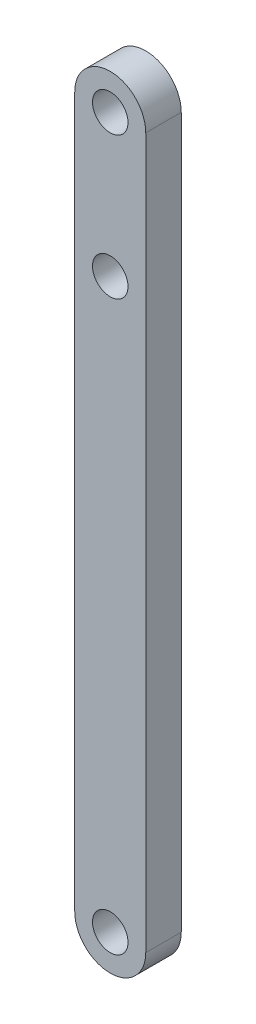
ISO-10303-21;
HEADER;
FILE_DESCRIPTION(('STEP AP214'),'2;1');
FILE_NAME('part.step','',(''),(''),'','','');
FILE_SCHEMA(('AUTOMOTIVE_DESIGN { 1 0 10303 214 1 1 1 1 }'));
ENDSEC;
DATA;
#1=APPLICATION_CONTEXT('core data for automotive mechanical design processes');
#2=APPLICATION_PROTOCOL_DEFINITION('international standard','automotive_design',2000,#1);
#3=PRODUCT_CONTEXT('',#1,'mechanical');
#4=PRODUCT('Part','Part','',(#3));
#5=PRODUCT_RELATED_PRODUCT_CATEGORY('part','',(#4));
#6=PRODUCT_DEFINITION_FORMATION('','',#4);
#7=PRODUCT_DEFINITION_CONTEXT('part definition',#1,'design');
#8=PRODUCT_DEFINITION('design','',#6,#7);
#9=PRODUCT_DEFINITION_SHAPE('','',#8);
#10=(LENGTH_UNIT() NAMED_UNIT(*) SI_UNIT(.MILLI.,.METRE.));
#11=(NAMED_UNIT(*) PLANE_ANGLE_UNIT() SI_UNIT($,.RADIAN.));
#12=(NAMED_UNIT(*) SI_UNIT($,.STERADIAN.) SOLID_ANGLE_UNIT());
#13=UNCERTAINTY_MEASURE_WITH_UNIT(LENGTH_MEASURE(1.E-05),#10,'distance_accuracy_value','');
#14=(GEOMETRIC_REPRESENTATION_CONTEXT(3) GLOBAL_UNCERTAINTY_ASSIGNED_CONTEXT((#13)) GLOBAL_UNIT_ASSIGNED_CONTEXT((#10,
#11,#12)) REPRESENTATION_CONTEXT('',''));
#15=CARTESIAN_POINT('',(0.,0.,0.));
#16=DIRECTION('',(0.,0.,1.));
#17=DIRECTION('',(1.,0.,0.));
#18=AXIS2_PLACEMENT_3D('',#15,#16,#17);
#19=CARTESIAN_POINT('',(3.,0.,3.));
#20=DIRECTION('',(0.,0.,-1.));
#21=DIRECTION('',(-1.,0.,0.));
#22=AXIS2_PLACEMENT_3D('',#19,#20,#21);
#23=CYLINDRICAL_SURFACE('',#22,3.);
#24=CARTESIAN_POINT('',(3.,0.,0.));
#25=DIRECTION('',(0.,0.,1.));
#26=DIRECTION('',(1.,0.,0.));
#27=AXIS2_PLACEMENT_3D('',#24,#25,#26);
#28=CIRCLE('',#27,3.);
#29=CARTESIAN_POINT('',(0.,0.,0.));
#30=VERTEX_POINT('',#29);
#31=CARTESIAN_POINT('',(6.,0.,0.));
#32=VERTEX_POINT('',#31);
#33=EDGE_CURVE('E99',#30,#32,#28,.T.);
#34=ORIENTED_EDGE('',*,*,#33,.T.);
#35=DIRECTION('',(0.,0.,-1.));
#36=VECTOR('',#35,1.);
#37=CARTESIAN_POINT('',(6.,0.,3.));
#38=LINE('',#37,#36);
#39=CARTESIAN_POINT('',(6.,0.,3.));
#40=VERTEX_POINT('',#39);
#41=EDGE_CURVE('E11',#40,#32,#38,.T.);
#42=ORIENTED_EDGE('',*,*,#41,.F.);
#43=CARTESIAN_POINT('',(3.,0.,3.));
#44=DIRECTION('',(0.,0.,1.));
#45=DIRECTION('',(1.,0.,0.));
#46=AXIS2_PLACEMENT_3D('',#43,#44,#45);
#47=CIRCLE('',#46,3.);
#48=CARTESIAN_POINT('',(0.,0.,3.));
#49=VERTEX_POINT('',#48);
#50=EDGE_CURVE('E87',#49,#40,#47,.T.);
#51=ORIENTED_EDGE('',*,*,#50,.F.);
#52=DIRECTION('',(0.,0.,-1.));
#53=VECTOR('',#52,1.);
#54=CARTESIAN_POINT('',(0.,0.,3.));
#55=LINE('',#54,#53);
#56=EDGE_CURVE('E95',#49,#30,#55,.T.);
#57=ORIENTED_EDGE('',*,*,#56,.T.);
#58=EDGE_LOOP('',(#34,#42,#51,#57));
#59=FACE_BOUND('',#58,.T.);
#60=ADVANCED_FACE('F36',(#59),#23,.T.);
#61=CARTESIAN_POINT('',(6.,60.,3.));
#62=DIRECTION('',(-1.,0.,0.));
#63=DIRECTION('',(0.,0.,1.));
#64=AXIS2_PLACEMENT_3D('',#61,#62,#63);
#65=PLANE('',#64);
#66=DIRECTION('',(0.,1.,0.));
#67=VECTOR('',#66,1.);
#68=CARTESIAN_POINT('',(6.,60.,0.));
#69=LINE('',#68,#67);
#70=CARTESIAN_POINT('',(6.,60.,0.));
#71=VERTEX_POINT('',#70);
#72=EDGE_CURVE('E91',#32,#71,#69,.T.);
#73=ORIENTED_EDGE('',*,*,#72,.T.);
#74=DIRECTION('',(0.,0.,-1.));
#75=VECTOR('',#74,1.);
#76=CARTESIAN_POINT('',(6.,60.,3.));
#77=LINE('',#76,#75);
#78=CARTESIAN_POINT('',(6.,60.,3.));
#79=VERTEX_POINT('',#78);
#80=EDGE_CURVE('E44',#79,#71,#77,.T.);
#81=ORIENTED_EDGE('',*,*,#80,.F.);
#82=DIRECTION('',(0.,1.,0.));
#83=VECTOR('',#82,1.);
#84=CARTESIAN_POINT('',(6.,60.,3.));
#85=LINE('',#84,#83);
#86=EDGE_CURVE('E82',#40,#79,#85,.T.);
#87=ORIENTED_EDGE('',*,*,#86,.F.);
#88=ORIENTED_EDGE('',*,*,#41,.T.);
#89=EDGE_LOOP('',(#73,#81,#87,#88));
#90=FACE_BOUND('',#89,.T.);
#91=ADVANCED_FACE('F90',(#90),#65,.F.);
#92=CARTESIAN_POINT('',(3.,60.,3.));
#93=DIRECTION('',(0.,0.,-1.));
#94=DIRECTION('',(-1.,0.,0.));
#95=AXIS2_PLACEMENT_3D('',#92,#93,#94);
#96=CYLINDRICAL_SURFACE('',#95,3.);
#97=CARTESIAN_POINT('',(3.,60.,0.));
#98=DIRECTION('',(0.,0.,1.));
#99=DIRECTION('',(1.,0.,0.));
#100=AXIS2_PLACEMENT_3D('',#97,#98,#99);
#101=CIRCLE('',#100,3.);
#102=CARTESIAN_POINT('',(0.,60.,0.));
#103=VERTEX_POINT('',#102);
#104=EDGE_CURVE('E69',#71,#103,#101,.T.);
#105=ORIENTED_EDGE('',*,*,#104,.T.);
#106=DIRECTION('',(0.,0.,-1.));
#107=VECTOR('',#106,1.);
#108=CARTESIAN_POINT('',(0.,60.,3.));
#109=LINE('',#108,#107);
#110=CARTESIAN_POINT('',(0.,60.,3.));
#111=VERTEX_POINT('',#110);
#112=EDGE_CURVE('E92',#111,#103,#109,.T.);
#113=ORIENTED_EDGE('',*,*,#112,.F.);
#114=CARTESIAN_POINT('',(3.,60.,3.));
#115=DIRECTION('',(0.,0.,1.));
#116=DIRECTION('',(1.,0.,0.));
#117=AXIS2_PLACEMENT_3D('',#114,#115,#116);
#118=CIRCLE('',#117,3.);
#119=EDGE_CURVE('E85',#79,#111,#118,.T.);
#120=ORIENTED_EDGE('',*,*,#119,.F.);
#121=ORIENTED_EDGE('',*,*,#80,.T.);
#122=EDGE_LOOP('',(#105,#113,#120,#121));
#123=FACE_BOUND('',#122,.T.);
#124=ADVANCED_FACE('F93',(#123),#96,.T.);
#125=CARTESIAN_POINT('',(0.,0.,3.));
#126=DIRECTION('',(1.,0.,0.));
#127=DIRECTION('',(0.,0.,-1.));
#128=AXIS2_PLACEMENT_3D('',#125,#126,#127);
#129=PLANE('',#128);
#130=DIRECTION('',(0.,-1.,0.));
#131=VECTOR('',#130,1.);
#132=CARTESIAN_POINT('',(0.,0.,0.));
#133=LINE('',#132,#131);
#134=EDGE_CURVE('E75',#103,#30,#133,.T.);
#135=ORIENTED_EDGE('',*,*,#134,.T.);
#136=ORIENTED_EDGE('',*,*,#56,.F.);
#137=DIRECTION('',(0.,-1.,0.));
#138=VECTOR('',#137,1.);
#139=CARTESIAN_POINT('',(0.,0.,3.));
#140=LINE('',#139,#138);
#141=EDGE_CURVE('E52',#111,#49,#140,.T.);
#142=ORIENTED_EDGE('',*,*,#141,.F.);
#143=ORIENTED_EDGE('',*,*,#112,.T.);
#144=EDGE_LOOP('',(#135,#136,#142,#143));
#145=FACE_BOUND('',#144,.T.);
#146=ADVANCED_FACE('F107',(#145),#129,.F.);
#147=CARTESIAN_POINT('',(3.,0.,3.));
#148=DIRECTION('',(0.,0.,1.));
#149=DIRECTION('',(1.,0.,0.));
#150=AXIS2_PLACEMENT_3D('',#147,#148,#149);
#151=PLANE('',#150);
#152=CARTESIAN_POINT('',(3.,0.,3.));
#153=DIRECTION('',(0.,0.,1.));
#154=DIRECTION('',(1.,0.,0.));
#155=AXIS2_PLACEMENT_3D('',#152,#153,#154);
#156=CIRCLE('',#155,1.5);
#157=CARTESIAN_POINT('',(4.5,0.,3.));
#158=VERTEX_POINT('',#157);
#159=EDGE_CURVE('E102',#158,#158,#156,.F.);
#160=ORIENTED_EDGE('',*,*,#159,.T.);
#161=EDGE_LOOP('',(#160));
#162=FACE_BOUND('',#161,.T.);
#163=CARTESIAN_POINT('',(3.,60.,3.));
#164=DIRECTION('',(0.,0.,1.));
#165=DIRECTION('',(1.,0.,0.));
#166=AXIS2_PLACEMENT_3D('',#163,#164,#165);
#167=CIRCLE('',#166,1.5);
#168=CARTESIAN_POINT('',(4.5,60.,3.));
#169=VERTEX_POINT('',#168);
#170=EDGE_CURVE('E115',#169,#169,#167,.F.);
#171=ORIENTED_EDGE('',*,*,#170,.T.);
#172=EDGE_LOOP('',(#171));
#173=FACE_BOUND('',#172,.T.);
#174=CARTESIAN_POINT('',(3.,48.,3.));
#175=DIRECTION('',(0.,0.,1.));
#176=DIRECTION('',(1.,0.,0.));
#177=AXIS2_PLACEMENT_3D('',#174,#175,#176);
#178=CIRCLE('',#177,1.5);
#179=CARTESIAN_POINT('',(4.5,48.,3.));
#180=VERTEX_POINT('',#179);
#181=EDGE_CURVE('E118',#180,#180,#178,.F.);
#182=ORIENTED_EDGE('',*,*,#181,.T.);
#183=EDGE_LOOP('',(#182));
#184=FACE_BOUND('',#183,.T.);
#185=ORIENTED_EDGE('',*,*,#50,.T.);
#186=ORIENTED_EDGE('',*,*,#86,.T.);
#187=ORIENTED_EDGE('',*,*,#119,.T.);
#188=ORIENTED_EDGE('',*,*,#141,.T.);
#189=EDGE_LOOP('',(#185,#186,#187,#188));
#190=FACE_BOUND('',#189,.T.);
#191=ADVANCED_FACE('F83',(#162,#173,#184,#190),#151,.T.);
#192=CARTESIAN_POINT('',(3.,0.,0.));
#193=DIRECTION('',(0.,0.,1.));
#194=DIRECTION('',(1.,0.,0.));
#195=AXIS2_PLACEMENT_3D('',#192,#193,#194);
#196=PLANE('',#195);
#197=CARTESIAN_POINT('',(3.,0.,0.));
#198=DIRECTION('',(0.,0.,1.));
#199=DIRECTION('',(1.,0.,0.));
#200=AXIS2_PLACEMENT_3D('',#197,#198,#199);
#201=CIRCLE('',#200,1.5);
#202=CARTESIAN_POINT('',(4.5,0.,0.));
#203=VERTEX_POINT('',#202);
#204=EDGE_CURVE('E121',#203,#203,#201,.T.);
#205=ORIENTED_EDGE('',*,*,#204,.T.);
#206=EDGE_LOOP('',(#205));
#207=FACE_BOUND('',#206,.T.);
#208=CARTESIAN_POINT('',(3.,60.,0.));
#209=DIRECTION('',(0.,0.,1.));
#210=DIRECTION('',(1.,0.,0.));
#211=AXIS2_PLACEMENT_3D('',#208,#209,#210);
#212=CIRCLE('',#211,1.5);
#213=CARTESIAN_POINT('',(4.5,60.,0.));
#214=VERTEX_POINT('',#213);
#215=EDGE_CURVE('E125',#214,#214,#212,.T.);
#216=ORIENTED_EDGE('',*,*,#215,.T.);
#217=EDGE_LOOP('',(#216));
#218=FACE_BOUND('',#217,.T.);
#219=CARTESIAN_POINT('',(3.,48.,0.));
#220=DIRECTION('',(0.,0.,1.));
#221=DIRECTION('',(1.,0.,0.));
#222=AXIS2_PLACEMENT_3D('',#219,#220,#221);
#223=CIRCLE('',#222,1.5);
#224=CARTESIAN_POINT('',(4.5,48.,0.));
#225=VERTEX_POINT('',#224);
#226=EDGE_CURVE('E122',#225,#225,#223,.T.);
#227=ORIENTED_EDGE('',*,*,#226,.T.);
#228=EDGE_LOOP('',(#227));
#229=FACE_BOUND('',#228,.T.);
#230=ORIENTED_EDGE('',*,*,#33,.F.);
#231=ORIENTED_EDGE('',*,*,#134,.F.);
#232=ORIENTED_EDGE('',*,*,#104,.F.);
#233=ORIENTED_EDGE('',*,*,#72,.F.);
#234=EDGE_LOOP('',(#230,#231,#232,#233));
#235=FACE_BOUND('',#234,.T.);
#236=ADVANCED_FACE('F110',(#207,#218,#229,#235),#196,.F.);
#237=CARTESIAN_POINT('',(3.,48.,5.));
#238=DIRECTION('',(0.,0.,-1.));
#239=DIRECTION('',(-1.,0.,0.));
#240=AXIS2_PLACEMENT_3D('',#237,#238,#239);
#241=CYLINDRICAL_SURFACE('',#240,1.5);
#242=ORIENTED_EDGE('',*,*,#181,.F.);
#243=EDGE_LOOP('',(#242));
#244=FACE_BOUND('',#243,.T.);
#245=ORIENTED_EDGE('',*,*,#226,.F.);
#246=EDGE_LOOP('',(#245));
#247=FACE_BOUND('',#246,.T.);
#248=ADVANCED_FACE('F141',(#244,#247),#241,.F.);
#249=CARTESIAN_POINT('',(3.,60.,5.));
#250=DIRECTION('',(0.,0.,-1.));
#251=DIRECTION('',(-1.,0.,0.));
#252=AXIS2_PLACEMENT_3D('',#249,#250,#251);
#253=CYLINDRICAL_SURFACE('',#252,1.5);
#254=ORIENTED_EDGE('',*,*,#170,.F.);
#255=EDGE_LOOP('',(#254));
#256=FACE_BOUND('',#255,.T.);
#257=ORIENTED_EDGE('',*,*,#215,.F.);
#258=EDGE_LOOP('',(#257));
#259=FACE_BOUND('',#258,.T.);
#260=ADVANCED_FACE('F135',(#256,#259),#253,.F.);
#261=CARTESIAN_POINT('',(3.,0.,5.));
#262=DIRECTION('',(0.,0.,-1.));
#263=DIRECTION('',(-1.,0.,0.));
#264=AXIS2_PLACEMENT_3D('',#261,#262,#263);
#265=CYLINDRICAL_SURFACE('',#264,1.5);
#266=ORIENTED_EDGE('',*,*,#159,.F.);
#267=EDGE_LOOP('',(#266));
#268=FACE_BOUND('',#267,.T.);
#269=ORIENTED_EDGE('',*,*,#204,.F.);
#270=EDGE_LOOP('',(#269));
#271=FACE_BOUND('',#270,.T.);
#272=ADVANCED_FACE('F133',(#268,#271),#265,.F.);
#273=CLOSED_SHELL('',(#60,#91,#124,#146,#191,#236,#248,#260,#272));
#274=MANIFOLD_SOLID_BREP('B2',#273);
#275=ADVANCED_BREP_SHAPE_REPRESENTATION('',(#18,#274),#14);
#276=SHAPE_DEFINITION_REPRESENTATION(#9,#275);
ENDSEC;
END-ISO-10303-21;
